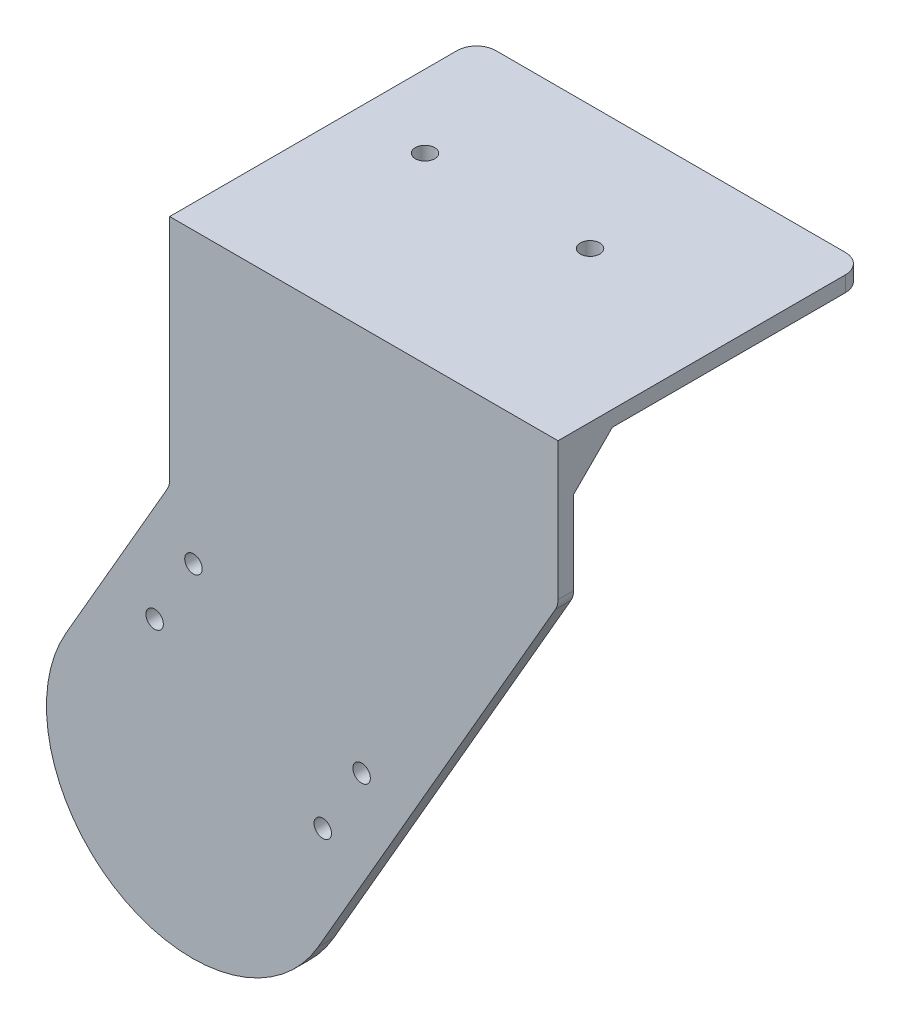
ISO-10303-21;
HEADER;
FILE_DESCRIPTION(('STEP AP214'),'2;1');
FILE_NAME('part.step','',(''),(''),'','','');
FILE_SCHEMA(('AUTOMOTIVE_DESIGN { 1 0 10303 214 1 1 1 1 }'));
ENDSEC;
DATA;
#1=APPLICATION_CONTEXT('core data for automotive mechanical design processes');
#2=APPLICATION_PROTOCOL_DEFINITION('international standard','automotive_design',2000,#1);
#3=PRODUCT_CONTEXT('',#1,'mechanical');
#4=PRODUCT('Part','Part','',(#3));
#5=PRODUCT_RELATED_PRODUCT_CATEGORY('part','',(#4));
#6=PRODUCT_DEFINITION_FORMATION('','',#4);
#7=PRODUCT_DEFINITION_CONTEXT('part definition',#1,'design');
#8=PRODUCT_DEFINITION('design','',#6,#7);
#9=PRODUCT_DEFINITION_SHAPE('','',#8);
#10=(LENGTH_UNIT() NAMED_UNIT(*) SI_UNIT(.MILLI.,.METRE.));
#11=(NAMED_UNIT(*) PLANE_ANGLE_UNIT() SI_UNIT($,.RADIAN.));
#12=(NAMED_UNIT(*) SI_UNIT($,.STERADIAN.) SOLID_ANGLE_UNIT());
#13=UNCERTAINTY_MEASURE_WITH_UNIT(LENGTH_MEASURE(1.E-05),#10,'distance_accuracy_value','');
#14=(GEOMETRIC_REPRESENTATION_CONTEXT(3) GLOBAL_UNCERTAINTY_ASSIGNED_CONTEXT((#13)) GLOBAL_UNIT_ASSIGNED_CONTEXT((#10,
#11,#12)) REPRESENTATION_CONTEXT('',''));
#15=CARTESIAN_POINT('',(0.,0.,0.));
#16=DIRECTION('',(0.,0.,1.));
#17=DIRECTION('',(1.,0.,0.));
#18=AXIS2_PLACEMENT_3D('',#15,#16,#17);
#19=CARTESIAN_POINT('',(0.,0.,8.));
#20=DIRECTION('',(0.,0.,-1.));
#21=DIRECTION('',(-1.,0.,0.));
#22=AXIS2_PLACEMENT_3D('',#19,#20,#21);
#23=CYLINDRICAL_SURFACE('',#22,75.);
#24=CARTESIAN_POINT('',(0.,0.,0.));
#25=DIRECTION('',(0.,0.,1.));
#26=DIRECTION('',(-1.,0.,0.));
#27=AXIS2_PLACEMENT_3D('',#24,#25,#26);
#28=CIRCLE('',#27,75.);
#29=CARTESIAN_POINT('',(-64.9519052838328,37.5,0.));
#30=VERTEX_POINT('',#29);
#31=CARTESIAN_POINT('',(64.9519052838328,-37.5000000000001,0.));
#32=VERTEX_POINT('',#31);
#33=EDGE_CURVE('E148',#30,#32,#28,.T.);
#34=ORIENTED_EDGE('',*,*,#33,.T.);
#35=DIRECTION('',(0.,0.,-1.));
#36=VECTOR('',#35,1.);
#37=CARTESIAN_POINT('',(64.9519052838328,-37.5000000000001,8.));
#38=LINE('',#37,#36);
#39=CARTESIAN_POINT('',(64.9519052838328,-37.5000000000001,8.));
#40=VERTEX_POINT('',#39);
#41=EDGE_CURVE('E133',#40,#32,#38,.T.);
#42=ORIENTED_EDGE('',*,*,#41,.F.);
#43=CARTESIAN_POINT('',(0.,0.,8.));
#44=DIRECTION('',(0.,0.,1.));
#45=DIRECTION('',(-1.,0.,0.));
#46=AXIS2_PLACEMENT_3D('',#43,#44,#45);
#47=CIRCLE('',#46,75.);
#48=CARTESIAN_POINT('',(-64.9519052838328,37.5,8.));
#49=VERTEX_POINT('',#48);
#50=EDGE_CURVE('E137',#49,#40,#47,.T.);
#51=ORIENTED_EDGE('',*,*,#50,.F.);
#52=DIRECTION('',(0.,0.,-1.));
#53=VECTOR('',#52,1.);
#54=CARTESIAN_POINT('',(-64.9519052838328,37.5,8.));
#55=LINE('',#54,#53);
#56=EDGE_CURVE('E216',#49,#30,#55,.T.);
#57=ORIENTED_EDGE('',*,*,#56,.T.);
#58=EDGE_LOOP('',(#34,#42,#51,#57));
#59=FACE_BOUND('',#58,.T.);
#60=ADVANCED_FACE('F36',(#59),#23,.T.);
#61=CARTESIAN_POINT('',(64.9519052838328,-37.5000000000001,8.));
#62=DIRECTION('',(-0.866025403784438,0.500000000000001,0.));
#63=DIRECTION('',(-0.500000000000001,-0.866025403784438,0.));
#64=AXIS2_PLACEMENT_3D('',#61,#62,#63);
#65=PLANE('',#64);
#66=DIRECTION('',(0.500000000000001,0.866025403784438,0.));
#67=VECTOR('',#66,1.);
#68=CARTESIAN_POINT('',(64.9519052838328,-37.5000000000001,0.));
#69=LINE('',#68,#67);
#70=CARTESIAN_POINT('',(187.113248654052,174.089653438086,0.));
#71=VERTEX_POINT('',#70);
#72=EDGE_CURVE('E225',#32,#71,#69,.T.);
#73=ORIENTED_EDGE('',*,*,#72,.T.);
#74=DIRECTION('',(0.,0.,-1.));
#75=VECTOR('',#74,1.);
#76=CARTESIAN_POINT('',(187.113248654052,174.089653438086,8.));
#77=LINE('',#76,#75);
#78=CARTESIAN_POINT('',(187.113248654052,174.089653438086,8.));
#79=VERTEX_POINT('',#78);
#80=EDGE_CURVE('E57',#71,#79,#77,.F.);
#81=ORIENTED_EDGE('',*,*,#80,.T.);
#82=DIRECTION('',(0.500000000000001,0.866025403784438,0.));
#83=VECTOR('',#82,1.);
#84=CARTESIAN_POINT('',(64.9519052838328,-37.5000000000001,8.));
#85=LINE('',#84,#83);
#86=EDGE_CURVE('E129',#40,#79,#85,.T.);
#87=ORIENTED_EDGE('',*,*,#86,.F.);
#88=ORIENTED_EDGE('',*,*,#41,.T.);
#89=EDGE_LOOP('',(#73,#81,#87,#88));
#90=FACE_BOUND('',#89,.T.);
#91=ADVANCED_FACE('F131',(#90),#65,.F.);
#92=CARTESIAN_POINT('',(188.452994616208,250.,8.));
#93=DIRECTION('',(-1.,0.,0.));
#94=DIRECTION('',(0.,0.,1.));
#95=AXIS2_PLACEMENT_3D('',#92,#93,#94);
#96=PLANE('',#95);
#97=DIRECTION('',(0.,0.,-1.));
#98=VECTOR('',#97,1.);
#99=CARTESIAN_POINT('',(188.452994616208,242.,0.));
#100=LINE('',#99,#98);
#101=CARTESIAN_POINT('',(188.452994616208,242.,-20.0000000000002));
#102=VERTEX_POINT('',#101);
#103=CARTESIAN_POINT('',(188.452994616208,242.,-140.));
#104=VERTEX_POINT('',#103);
#105=EDGE_CURVE('E226',#102,#104,#100,.T.);
#106=ORIENTED_EDGE('',*,*,#105,.T.);
#107=DIRECTION('',(0.,1.,0.));
#108=VECTOR('',#107,1.);
#109=CARTESIAN_POINT('',(188.452994616208,250.,-140.));
#110=LINE('',#109,#108);
#111=CARTESIAN_POINT('',(188.452994616208,250.,-140.));
#112=VERTEX_POINT('',#111);
#113=EDGE_CURVE('E186',#104,#112,#110,.T.);
#114=ORIENTED_EDGE('',*,*,#113,.T.);
#115=DIRECTION('',(0.,0.,-1.));
#116=VECTOR('',#115,1.);
#117=CARTESIAN_POINT('',(188.452994616208,250.,8.));
#118=LINE('',#117,#116);
#119=CARTESIAN_POINT('',(188.452994616208,250.,8.));
#120=VERTEX_POINT('',#119);
#121=EDGE_CURVE('E150',#120,#112,#118,.T.);
#122=ORIENTED_EDGE('',*,*,#121,.F.);
#123=DIRECTION('',(0.,1.,0.));
#124=VECTOR('',#123,1.);
#125=CARTESIAN_POINT('',(188.452994616208,250.,8.));
#126=LINE('',#125,#124);
#127=CARTESIAN_POINT('',(188.452994616208,179.089653438086,8.));
#128=VERTEX_POINT('',#127);
#129=EDGE_CURVE('E136',#128,#120,#126,.T.);
#130=ORIENTED_EDGE('',*,*,#129,.F.);
#131=DIRECTION('',(0.,0.,-1.));
#132=VECTOR('',#131,1.);
#133=CARTESIAN_POINT('',(188.452994616208,179.089653438086,8.));
#134=LINE('',#133,#132);
#135=CARTESIAN_POINT('',(188.452994616208,179.089653438086,0.));
#136=VERTEX_POINT('',#135);
#137=EDGE_CURVE('E183',#128,#136,#134,.T.);
#138=ORIENTED_EDGE('',*,*,#137,.T.);
#139=DIRECTION('',(0.,1.,0.));
#140=VECTOR('',#139,1.);
#141=CARTESIAN_POINT('',(188.452994616208,250.,0.));
#142=LINE('',#141,#140);
#143=CARTESIAN_POINT('',(188.452994616208,222.,0.));
#144=VERTEX_POINT('',#143);
#145=EDGE_CURVE('E212',#136,#144,#142,.T.);
#146=ORIENTED_EDGE('',*,*,#145,.T.);
#147=DIRECTION('',(0.,-0.707106781186544,0.707106781186551));
#148=VECTOR('',#147,1.);
#149=CARTESIAN_POINT('',(188.452994616208,232.,-9.99999999999993));
#150=LINE('',#149,#148);
#151=EDGE_CURVE('E164',#144,#102,#150,.F.);
#152=ORIENTED_EDGE('',*,*,#151,.T.);
#153=EDGE_LOOP('',(#106,#114,#122,#130,#138,#146,#152));
#154=FACE_BOUND('',#153,.T.);
#155=ADVANCED_FACE('F262',(#154),#96,.F.);
#156=CARTESIAN_POINT('',(-11.5470053837924,250.,8.));
#157=DIRECTION('',(0.,-1.,0.));
#158=DIRECTION('',(0.,0.,-1.));
#159=AXIS2_PLACEMENT_3D('',#156,#157,#158);
#160=PLANE('',#159);
#161=CARTESIAN_POINT('',(110.952994616208,250.,-86.));
#162=DIRECTION('',(0.,1.,0.));
#163=DIRECTION('',(0.,0.,1.));
#164=AXIS2_PLACEMENT_3D('',#161,#162,#163);
#165=CIRCLE('',#164,4.99999999999999);
#166=CARTESIAN_POINT('',(110.952994616208,250.,-81.));
#167=VERTEX_POINT('',#166);
#168=EDGE_CURVE('E253',#167,#167,#165,.T.);
#169=ORIENTED_EDGE('',*,*,#168,.F.);
#170=EDGE_LOOP('',(#169));
#171=FACE_BOUND('',#170,.T.);
#172=CARTESIAN_POINT('',(25.9529946162076,250.,-86.));
#173=DIRECTION('',(0.,1.,0.));
#174=DIRECTION('',(0.,0.,1.));
#175=AXIS2_PLACEMENT_3D('',#172,#173,#174);
#176=CIRCLE('',#175,5.);
#177=CARTESIAN_POINT('',(25.9529946162076,250.,-81.));
#178=VERTEX_POINT('',#177);
#179=EDGE_CURVE('E475',#178,#178,#176,.T.);
#180=ORIENTED_EDGE('',*,*,#179,.F.);
#181=EDGE_LOOP('',(#180));
#182=FACE_BOUND('',#181,.T.);
#183=DIRECTION('',(-1.,0.,0.));
#184=VECTOR('',#183,1.);
#185=CARTESIAN_POINT('',(338.666176461211,250.,-150.));
#186=LINE('',#185,#184);
#187=CARTESIAN_POINT('',(178.452994616208,250.,-150.));
#188=VERTEX_POINT('',#187);
#189=CARTESIAN_POINT('',(-1.54700538379238,250.,-150.));
#190=VERTEX_POINT('',#189);
#191=EDGE_CURVE('E250',#188,#190,#186,.T.);
#192=ORIENTED_EDGE('',*,*,#191,.T.);
#193=CARTESIAN_POINT('',(-1.5470053837924,250.,-140.));
#194=DIRECTION('',(0.,-1.,0.));
#195=DIRECTION('',(0.,0.,-1.));
#196=AXIS2_PLACEMENT_3D('',#193,#194,#195);
#197=CIRCLE('',#196,10.);
#198=CARTESIAN_POINT('',(-11.5470053837924,250.,-140.));
#199=VERTEX_POINT('',#198);
#200=EDGE_CURVE('E181',#190,#199,#197,.F.);
#201=ORIENTED_EDGE('',*,*,#200,.T.);
#202=DIRECTION('',(0.,0.,-1.));
#203=VECTOR('',#202,1.);
#204=CARTESIAN_POINT('',(-11.5470053837924,250.,8.));
#205=LINE('',#204,#203);
#206=CARTESIAN_POINT('',(-11.5470053837924,250.,8.));
#207=VERTEX_POINT('',#206);
#208=EDGE_CURVE('E156',#207,#199,#205,.T.);
#209=ORIENTED_EDGE('',*,*,#208,.F.);
#210=DIRECTION('',(-1.,0.,0.));
#211=VECTOR('',#210,1.);
#212=CARTESIAN_POINT('',(-11.5470053837924,250.,8.));
#213=LINE('',#212,#211);
#214=EDGE_CURVE('E220',#120,#207,#213,.T.);
#215=ORIENTED_EDGE('',*,*,#214,.F.);
#216=ORIENTED_EDGE('',*,*,#121,.T.);
#217=CARTESIAN_POINT('',(178.452994616208,250.,-140.));
#218=DIRECTION('',(0.,-1.,0.));
#219=DIRECTION('',(0.,0.,-1.));
#220=AXIS2_PLACEMENT_3D('',#217,#218,#219);
#221=CIRCLE('',#220,10.);
#222=EDGE_CURVE('E179',#112,#188,#221,.F.);
#223=ORIENTED_EDGE('',*,*,#222,.T.);
#224=EDGE_LOOP('',(#192,#201,#209,#215,#216,#223));
#225=FACE_BOUND('',#224,.T.);
#226=ADVANCED_FACE('F260',(#171,#182,#225),#160,.F.);
#227=CARTESIAN_POINT('',(-11.5470053837924,130.,8.));
#228=DIRECTION('',(1.,0.,0.));
#229=DIRECTION('',(0.,0.,-1.));
#230=AXIS2_PLACEMENT_3D('',#227,#228,#229);
#231=PLANE('',#230);
#232=ORIENTED_EDGE('',*,*,#208,.T.);
#233=DIRECTION('',(0.,-1.,0.));
#234=VECTOR('',#233,1.);
#235=CARTESIAN_POINT('',(-11.5470053837924,242.,-140.));
#236=LINE('',#235,#234);
#237=CARTESIAN_POINT('',(-11.5470053837924,242.,-140.));
#238=VERTEX_POINT('',#237);
#239=EDGE_CURVE('E168',#199,#238,#236,.T.);
#240=ORIENTED_EDGE('',*,*,#239,.T.);
#241=DIRECTION('',(0.,0.,1.));
#242=VECTOR('',#241,1.);
#243=CARTESIAN_POINT('',(-11.5470053837924,242.,0.));
#244=LINE('',#243,#242);
#245=CARTESIAN_POINT('',(-11.5470053837924,242.,-20.0000000000002));
#246=VERTEX_POINT('',#245);
#247=EDGE_CURVE('E244',#238,#246,#244,.T.);
#248=ORIENTED_EDGE('',*,*,#247,.T.);
#249=DIRECTION('',(0.,0.707106781186544,-0.707106781186551));
#250=VECTOR('',#249,1.);
#251=CARTESIAN_POINT('',(-11.5470053837924,172.000000000001,50.0000000000001));
#252=LINE('',#251,#250);
#253=CARTESIAN_POINT('',(-11.5470053837924,222.,0.));
#254=VERTEX_POINT('',#253);
#255=EDGE_CURVE('E162',#246,#254,#252,.F.);
#256=ORIENTED_EDGE('',*,*,#255,.T.);
#257=DIRECTION('',(0.,-1.,0.));
#258=VECTOR('',#257,1.);
#259=CARTESIAN_POINT('',(-11.5470053837924,130.,0.));
#260=LINE('',#259,#258);
#261=CARTESIAN_POINT('',(-11.5470053837924,132.679491924311,0.));
#262=VERTEX_POINT('',#261);
#263=EDGE_CURVE('E202',#254,#262,#260,.T.);
#264=ORIENTED_EDGE('',*,*,#263,.T.);
#265=DIRECTION('',(0.,0.,-1.));
#266=VECTOR('',#265,1.);
#267=CARTESIAN_POINT('',(-11.5470053837924,132.679491924311,8.));
#268=LINE('',#267,#266);
#269=CARTESIAN_POINT('',(-11.5470053837924,132.679491924311,8.));
#270=VERTEX_POINT('',#269);
#271=EDGE_CURVE('E166',#262,#270,#268,.F.);
#272=ORIENTED_EDGE('',*,*,#271,.T.);
#273=DIRECTION('',(0.,-1.,0.));
#274=VECTOR('',#273,1.);
#275=CARTESIAN_POINT('',(-11.5470053837924,130.,8.));
#276=LINE('',#275,#274);
#277=EDGE_CURVE('E217',#207,#270,#276,.T.);
#278=ORIENTED_EDGE('',*,*,#277,.F.);
#279=EDGE_LOOP('',(#232,#240,#248,#256,#264,#272,#278));
#280=FACE_BOUND('',#279,.T.);
#281=ADVANCED_FACE('F209',(#280),#231,.F.);
#282=CARTESIAN_POINT('',(-64.9519052838328,37.5,8.));
#283=DIRECTION('',(0.866025403784438,-0.5,0.));
#284=DIRECTION('',(0.5,0.866025403784438,0.));
#285=AXIS2_PLACEMENT_3D('',#282,#283,#284);
#286=PLANE('',#285);
#287=DIRECTION('',(-0.5,-0.866025403784438,0.));
#288=VECTOR('',#287,1.);
#289=CARTESIAN_POINT('',(-64.9519052838328,37.5,8.));
#290=LINE('',#289,#288);
#291=CARTESIAN_POINT('',(-12.886751345948,127.679491924311,8.));
#292=VERTEX_POINT('',#291);
#293=EDGE_CURVE('E141',#292,#49,#290,.T.);
#294=ORIENTED_EDGE('',*,*,#293,.F.);
#295=DIRECTION('',(0.,0.,-1.));
#296=VECTOR('',#295,1.);
#297=CARTESIAN_POINT('',(-12.886751345948,127.679491924311,0.));
#298=LINE('',#297,#296);
#299=CARTESIAN_POINT('',(-12.886751345948,127.679491924311,0.));
#300=VERTEX_POINT('',#299);
#301=EDGE_CURVE('E194',#292,#300,#298,.T.);
#302=ORIENTED_EDGE('',*,*,#301,.T.);
#303=DIRECTION('',(-0.5,-0.866025403784438,0.));
#304=VECTOR('',#303,1.);
#305=CARTESIAN_POINT('',(-64.9519052838328,37.5,0.));
#306=LINE('',#305,#304);
#307=EDGE_CURVE('E145',#300,#30,#306,.T.);
#308=ORIENTED_EDGE('',*,*,#307,.T.);
#309=ORIENTED_EDGE('',*,*,#56,.F.);
#310=EDGE_LOOP('',(#294,#302,#308,#309));
#311=FACE_BOUND('',#310,.T.);
#312=ADVANCED_FACE('F215',(#311),#286,.F.);
#313=CARTESIAN_POINT('',(0.,0.,8.));
#314=DIRECTION('',(0.,0.,-1.));
#315=DIRECTION('',(-1.,0.,0.));
#316=AXIS2_PLACEMENT_3D('',#313,#314,#315);
#317=PLANE('',#316);
#318=CARTESIAN_POINT('',(87.301270189222,51.2102355330306,8.));
#319=DIRECTION('',(0.,0.,-1.));
#320=DIRECTION('',(-1.,0.,0.));
#321=AXIS2_PLACEMENT_3D('',#318,#319,#320);
#322=CIRCLE('',#321,4.50000000000001);
#323=CARTESIAN_POINT('',(82.801270189222,51.2102355330306,8.));
#324=VERTEX_POINT('',#323);
#325=EDGE_CURVE('E505',#324,#324,#322,.T.);
#326=ORIENTED_EDGE('',*,*,#325,.T.);
#327=EDGE_LOOP('',(#326));
#328=FACE_BOUND('',#327,.T.);
#329=CARTESIAN_POINT('',(67.301270189222,16.569219381653,8.));
#330=DIRECTION('',(0.,0.,-1.));
#331=DIRECTION('',(-1.,0.,0.));
#332=AXIS2_PLACEMENT_3D('',#329,#330,#331);
#333=CIRCLE('',#332,4.5);
#334=CARTESIAN_POINT('',(62.801270189222,16.569219381653,8.));
#335=VERTEX_POINT('',#334);
#336=EDGE_CURVE('E499',#335,#335,#333,.T.);
#337=ORIENTED_EDGE('',*,*,#336,.T.);
#338=EDGE_LOOP('',(#337));
#339=FACE_BOUND('',#338,.T.);
#340=CARTESIAN_POINT('',(-19.3012701892219,66.569219381653,8.));
#341=DIRECTION('',(0.,0.,-1.));
#342=DIRECTION('',(-1.,0.,0.));
#343=AXIS2_PLACEMENT_3D('',#340,#341,#342);
#344=CIRCLE('',#343,4.50000000000002);
#345=CARTESIAN_POINT('',(-23.8012701892219,66.569219381653,8.));
#346=VERTEX_POINT('',#345);
#347=EDGE_CURVE('E493',#346,#346,#344,.T.);
#348=ORIENTED_EDGE('',*,*,#347,.T.);
#349=EDGE_LOOP('',(#348));
#350=FACE_BOUND('',#349,.T.);
#351=CARTESIAN_POINT('',(0.698729810778129,101.210235533031,8.));
#352=DIRECTION('',(0.,0.,-1.));
#353=DIRECTION('',(-1.,0.,0.));
#354=AXIS2_PLACEMENT_3D('',#351,#352,#353);
#355=CIRCLE('',#354,4.50000000000002);
#356=CARTESIAN_POINT('',(-3.8012701892219,101.210235533031,8.));
#357=VERTEX_POINT('',#356);
#358=EDGE_CURVE('E487',#357,#357,#355,.T.);
#359=ORIENTED_EDGE('',*,*,#358,.T.);
#360=EDGE_LOOP('',(#359));
#361=FACE_BOUND('',#360,.T.);
#362=ORIENTED_EDGE('',*,*,#86,.T.);
#363=CARTESIAN_POINT('',(178.452994616208,179.089653438086,8.));
#364=DIRECTION('',(0.,0.,-1.));
#365=DIRECTION('',(-1.,0.,0.));
#366=AXIS2_PLACEMENT_3D('',#363,#364,#365);
#367=CIRCLE('',#366,10.);
#368=EDGE_CURVE('E192',#79,#128,#367,.F.);
#369=ORIENTED_EDGE('',*,*,#368,.T.);
#370=ORIENTED_EDGE('',*,*,#129,.T.);
#371=ORIENTED_EDGE('',*,*,#214,.T.);
#372=ORIENTED_EDGE('',*,*,#277,.T.);
#373=CARTESIAN_POINT('',(-21.5470053837924,132.679491924311,8.));
#374=DIRECTION('',(0.,0.,-1.));
#375=DIRECTION('',(-1.,0.,0.));
#376=AXIS2_PLACEMENT_3D('',#373,#374,#375);
#377=CIRCLE('',#376,10.);
#378=EDGE_CURVE('E11',#270,#292,#377,.T.);
#379=ORIENTED_EDGE('',*,*,#378,.T.);
#380=ORIENTED_EDGE('',*,*,#293,.T.);
#381=ORIENTED_EDGE('',*,*,#50,.T.);
#382=EDGE_LOOP('',(#362,#369,#370,#371,#372,#379,#380,#381));
#383=FACE_BOUND('',#382,.T.);
#384=ADVANCED_FACE('F140',(#328,#339,#350,#361,#383),#317,.F.);
#385=CARTESIAN_POINT('',(0.,0.,0.));
#386=DIRECTION('',(0.,0.,-1.));
#387=DIRECTION('',(-1.,0.,0.));
#388=AXIS2_PLACEMENT_3D('',#385,#386,#387);
#389=PLANE('',#388);
#390=CARTESIAN_POINT('',(87.301270189222,51.2102355330306,0.));
#391=DIRECTION('',(0.,0.,1.));
#392=DIRECTION('',(1.,0.,0.));
#393=AXIS2_PLACEMENT_3D('',#390,#391,#392);
#394=CIRCLE('',#393,4.50000000000001);
#395=CARTESIAN_POINT('',(91.801270189222,51.2102355330306,0.));
#396=VERTEX_POINT('',#395);
#397=EDGE_CURVE('E483',#396,#396,#394,.T.);
#398=ORIENTED_EDGE('',*,*,#397,.T.);
#399=EDGE_LOOP('',(#398));
#400=FACE_BOUND('',#399,.T.);
#401=CARTESIAN_POINT('',(67.301270189222,16.569219381653,0.));
#402=DIRECTION('',(0.,0.,1.));
#403=DIRECTION('',(1.,0.,0.));
#404=AXIS2_PLACEMENT_3D('',#401,#402,#403);
#405=CIRCLE('',#404,4.5);
#406=CARTESIAN_POINT('',(71.801270189222,16.569219381653,0.));
#407=VERTEX_POINT('',#406);
#408=EDGE_CURVE('E502',#407,#407,#405,.T.);
#409=ORIENTED_EDGE('',*,*,#408,.T.);
#410=EDGE_LOOP('',(#409));
#411=FACE_BOUND('',#410,.T.);
#412=CARTESIAN_POINT('',(-19.3012701892219,66.569219381653,0.));
#413=DIRECTION('',(0.,0.,1.));
#414=DIRECTION('',(1.,0.,0.));
#415=AXIS2_PLACEMENT_3D('',#412,#413,#414);
#416=CIRCLE('',#415,4.50000000000002);
#417=CARTESIAN_POINT('',(-14.8012701892219,66.569219381653,0.));
#418=VERTEX_POINT('',#417);
#419=EDGE_CURVE('E496',#418,#418,#416,.T.);
#420=ORIENTED_EDGE('',*,*,#419,.T.);
#421=EDGE_LOOP('',(#420));
#422=FACE_BOUND('',#421,.T.);
#423=CARTESIAN_POINT('',(0.698729810778129,101.210235533031,0.));
#424=DIRECTION('',(0.,0.,1.));
#425=DIRECTION('',(1.,0.,0.));
#426=AXIS2_PLACEMENT_3D('',#423,#424,#425);
#427=CIRCLE('',#426,4.50000000000002);
#428=CARTESIAN_POINT('',(5.19872981077815,101.210235533031,0.));
#429=VERTEX_POINT('',#428);
#430=EDGE_CURVE('E490',#429,#429,#427,.T.);
#431=ORIENTED_EDGE('',*,*,#430,.T.);
#432=EDGE_LOOP('',(#431));
#433=FACE_BOUND('',#432,.T.);
#434=ORIENTED_EDGE('',*,*,#145,.F.);
#435=CARTESIAN_POINT('',(178.452994616208,179.089653438086,0.));
#436=DIRECTION('',(0.,0.,-1.));
#437=DIRECTION('',(-1.,0.,0.));
#438=AXIS2_PLACEMENT_3D('',#435,#436,#437);
#439=CIRCLE('',#438,10.);
#440=EDGE_CURVE('E189',#136,#71,#439,.T.);
#441=ORIENTED_EDGE('',*,*,#440,.T.);
#442=ORIENTED_EDGE('',*,*,#72,.F.);
#443=ORIENTED_EDGE('',*,*,#33,.F.);
#444=ORIENTED_EDGE('',*,*,#307,.F.);
#445=CARTESIAN_POINT('',(-21.5470053837924,132.679491924311,0.));
#446=DIRECTION('',(0.,0.,-1.));
#447=DIRECTION('',(-1.,0.,0.));
#448=AXIS2_PLACEMENT_3D('',#445,#446,#447);
#449=CIRCLE('',#448,10.);
#450=EDGE_CURVE('E44',#300,#262,#449,.F.);
#451=ORIENTED_EDGE('',*,*,#450,.T.);
#452=ORIENTED_EDGE('',*,*,#263,.F.);
#453=DIRECTION('',(1.,0.,0.));
#454=VECTOR('',#453,1.);
#455=CARTESIAN_POINT('',(188.452994616208,222.,0.));
#456=LINE('',#455,#454);
#457=EDGE_CURVE('E153',#254,#144,#456,.T.);
#458=ORIENTED_EDGE('',*,*,#457,.T.);
#459=EDGE_LOOP('',(#434,#441,#442,#443,#444,#451,#452,#458));
#460=FACE_BOUND('',#459,.T.);
#461=ADVANCED_FACE('F201',(#400,#411,#422,#433,#460),#389,.T.);
#462=CARTESIAN_POINT('',(338.666176461211,-5.20417042793039E-13,-149.999999999999));
#463=DIRECTION('',(0.,0.,-1.));
#464=DIRECTION('',(0.,1.,0.));
#465=AXIS2_PLACEMENT_3D('',#462,#463,#464);
#466=PLANE('',#465);
#467=DIRECTION('',(-1.,0.,0.));
#468=VECTOR('',#467,1.);
#469=CARTESIAN_POINT('',(338.666176461211,242.,-150.));
#470=LINE('',#469,#468);
#471=CARTESIAN_POINT('',(178.452994616208,242.,-150.));
#472=VERTEX_POINT('',#471);
#473=CARTESIAN_POINT('',(-1.54700538379238,242.,-150.));
#474=VERTEX_POINT('',#473);
#475=EDGE_CURVE('E242',#472,#474,#470,.T.);
#476=ORIENTED_EDGE('',*,*,#475,.T.);
#477=DIRECTION('',(0.,-1.,0.));
#478=VECTOR('',#477,1.);
#479=CARTESIAN_POINT('',(-1.5470053837924,250.,-150.));
#480=LINE('',#479,#478);
#481=EDGE_CURVE('E177',#474,#190,#480,.F.);
#482=ORIENTED_EDGE('',*,*,#481,.T.);
#483=ORIENTED_EDGE('',*,*,#191,.F.);
#484=DIRECTION('',(0.,1.,0.));
#485=VECTOR('',#484,1.);
#486=CARTESIAN_POINT('',(178.452994616208,242.,-150.));
#487=LINE('',#486,#485);
#488=EDGE_CURVE('E175',#188,#472,#487,.F.);
#489=ORIENTED_EDGE('',*,*,#488,.T.);
#490=EDGE_LOOP('',(#476,#482,#483,#489));
#491=FACE_BOUND('',#490,.T.);
#492=ADVANCED_FACE('F246',(#491),#466,.T.);
#493=CARTESIAN_POINT('',(338.666176461211,242.,0.));
#494=DIRECTION('',(0.,-1.,0.));
#495=DIRECTION('',(0.,0.,-1.));
#496=AXIS2_PLACEMENT_3D('',#493,#494,#495);
#497=PLANE('',#496);
#498=CARTESIAN_POINT('',(110.952994616208,242.,-86.));
#499=DIRECTION('',(0.,-1.,0.));
#500=DIRECTION('',(0.,0.,-1.));
#501=AXIS2_PLACEMENT_3D('',#498,#499,#500);
#502=CIRCLE('',#501,4.99999999999999);
#503=CARTESIAN_POINT('',(110.952994616208,242.,-91.));
#504=VERTEX_POINT('',#503);
#505=EDGE_CURVE('E477',#504,#504,#502,.F.);
#506=ORIENTED_EDGE('',*,*,#505,.T.);
#507=EDGE_LOOP('',(#506));
#508=FACE_BOUND('',#507,.T.);
#509=CARTESIAN_POINT('',(25.9529946162076,242.,-86.));
#510=DIRECTION('',(0.,-1.,0.));
#511=DIRECTION('',(0.,0.,-1.));
#512=AXIS2_PLACEMENT_3D('',#509,#510,#511);
#513=CIRCLE('',#512,5.);
#514=CARTESIAN_POINT('',(25.9529946162076,242.,-91.));
#515=VERTEX_POINT('',#514);
#516=EDGE_CURVE('E478',#515,#515,#513,.F.);
#517=ORIENTED_EDGE('',*,*,#516,.T.);
#518=EDGE_LOOP('',(#517));
#519=FACE_BOUND('',#518,.T.);
#520=ORIENTED_EDGE('',*,*,#247,.F.);
#521=CARTESIAN_POINT('',(-1.5470053837924,242.,-140.));
#522=DIRECTION('',(0.,-1.,0.));
#523=DIRECTION('',(0.,0.,-1.));
#524=AXIS2_PLACEMENT_3D('',#521,#522,#523);
#525=CIRCLE('',#524,10.);
#526=EDGE_CURVE('E173',#238,#474,#525,.T.);
#527=ORIENTED_EDGE('',*,*,#526,.T.);
#528=ORIENTED_EDGE('',*,*,#475,.F.);
#529=CARTESIAN_POINT('',(178.452994616208,242.,-140.));
#530=DIRECTION('',(0.,-1.,0.));
#531=DIRECTION('',(0.,0.,-1.));
#532=AXIS2_PLACEMENT_3D('',#529,#530,#531);
#533=CIRCLE('',#532,10.);
#534=EDGE_CURVE('E171',#472,#104,#533,.T.);
#535=ORIENTED_EDGE('',*,*,#534,.T.);
#536=ORIENTED_EDGE('',*,*,#105,.F.);
#537=DIRECTION('',(-1.,0.,0.));
#538=VECTOR('',#537,1.);
#539=CARTESIAN_POINT('',(-11.5470053837924,242.,-20.0000000000002));
#540=LINE('',#539,#538);
#541=EDGE_CURVE('E149',#102,#246,#540,.T.);
#542=ORIENTED_EDGE('',*,*,#541,.T.);
#543=EDGE_LOOP('',(#520,#527,#528,#535,#536,#542));
#544=FACE_BOUND('',#543,.T.);
#545=ADVANCED_FACE('F241',(#508,#519,#544),#497,.T.);
#546=CARTESIAN_POINT('',(338.666176461211,242.,-20.0000000000002));
#547=DIRECTION('',(0.,-0.707106781186551,-0.707106781186543));
#548=DIRECTION('',(1.,0.,0.));
#549=AXIS2_PLACEMENT_3D('',#546,#547,#548);
#550=PLANE('',#549);
#551=ORIENTED_EDGE('',*,*,#151,.F.);
#552=ORIENTED_EDGE('',*,*,#457,.F.);
#553=ORIENTED_EDGE('',*,*,#255,.F.);
#554=ORIENTED_EDGE('',*,*,#541,.F.);
#555=EDGE_LOOP('',(#551,#552,#553,#554));
#556=FACE_BOUND('',#555,.T.);
#557=ADVANCED_FACE('F271',(#556),#550,.T.);
#558=CARTESIAN_POINT('',(25.9529946162076,-75.001,-86.));
#559=DIRECTION('',(0.,1.,0.));
#560=DIRECTION('',(0.,0.,1.));
#561=AXIS2_PLACEMENT_3D('',#558,#559,#560);
#562=CYLINDRICAL_SURFACE('',#561,5.);
#563=ORIENTED_EDGE('',*,*,#516,.F.);
#564=EDGE_LOOP('',(#563));
#565=FACE_BOUND('',#564,.T.);
#566=ORIENTED_EDGE('',*,*,#179,.T.);
#567=EDGE_LOOP('',(#566));
#568=FACE_BOUND('',#567,.T.);
#569=ADVANCED_FACE('F293',(#565,#568),#562,.F.);
#570=CARTESIAN_POINT('',(110.952994616208,-75.001,-86.));
#571=DIRECTION('',(0.,1.,0.));
#572=DIRECTION('',(0.,0.,1.));
#573=AXIS2_PLACEMENT_3D('',#570,#571,#572);
#574=CYLINDRICAL_SURFACE('',#573,4.99999999999999);
#575=ORIENTED_EDGE('',*,*,#505,.F.);
#576=EDGE_LOOP('',(#575));
#577=FACE_BOUND('',#576,.T.);
#578=ORIENTED_EDGE('',*,*,#168,.T.);
#579=EDGE_LOOP('',(#578));
#580=FACE_BOUND('',#579,.T.);
#581=ADVANCED_FACE('F317',(#577,#580),#574,.F.);
#582=CARTESIAN_POINT('',(0.698729810778129,101.210235533031,8.001));
#583=DIRECTION('',(0.,0.,-1.));
#584=DIRECTION('',(-1.,0.,0.));
#585=AXIS2_PLACEMENT_3D('',#582,#583,#584);
#586=CYLINDRICAL_SURFACE('',#585,4.50000000000002);
#587=ORIENTED_EDGE('',*,*,#430,.F.);
#588=EDGE_LOOP('',(#587));
#589=FACE_BOUND('',#588,.T.);
#590=ORIENTED_EDGE('',*,*,#358,.F.);
#591=EDGE_LOOP('',(#590));
#592=FACE_BOUND('',#591,.T.);
#593=ADVANCED_FACE('F313',(#589,#592),#586,.F.);
#594=CARTESIAN_POINT('',(-19.3012701892219,66.569219381653,8.001));
#595=DIRECTION('',(0.,0.,-1.));
#596=DIRECTION('',(-1.,0.,0.));
#597=AXIS2_PLACEMENT_3D('',#594,#595,#596);
#598=CYLINDRICAL_SURFACE('',#597,4.50000000000002);
#599=ORIENTED_EDGE('',*,*,#419,.F.);
#600=EDGE_LOOP('',(#599));
#601=FACE_BOUND('',#600,.T.);
#602=ORIENTED_EDGE('',*,*,#347,.F.);
#603=EDGE_LOOP('',(#602));
#604=FACE_BOUND('',#603,.T.);
#605=ADVANCED_FACE('F305',(#601,#604),#598,.F.);
#606=CARTESIAN_POINT('',(67.301270189222,16.569219381653,8.001));
#607=DIRECTION('',(0.,0.,-1.));
#608=DIRECTION('',(-1.,0.,0.));
#609=AXIS2_PLACEMENT_3D('',#606,#607,#608);
#610=CYLINDRICAL_SURFACE('',#609,4.5);
#611=ORIENTED_EDGE('',*,*,#408,.F.);
#612=EDGE_LOOP('',(#611));
#613=FACE_BOUND('',#612,.T.);
#614=ORIENTED_EDGE('',*,*,#336,.F.);
#615=EDGE_LOOP('',(#614));
#616=FACE_BOUND('',#615,.T.);
#617=ADVANCED_FACE('F299',(#613,#616),#610,.F.);
#618=CARTESIAN_POINT('',(87.301270189222,51.2102355330306,8.001));
#619=DIRECTION('',(0.,0.,-1.));
#620=DIRECTION('',(-1.,0.,0.));
#621=AXIS2_PLACEMENT_3D('',#618,#619,#620);
#622=CYLINDRICAL_SURFACE('',#621,4.50000000000001);
#623=ORIENTED_EDGE('',*,*,#397,.F.);
#624=EDGE_LOOP('',(#623));
#625=FACE_BOUND('',#624,.T.);
#626=ORIENTED_EDGE('',*,*,#325,.F.);
#627=EDGE_LOOP('',(#626));
#628=FACE_BOUND('',#627,.T.);
#629=ADVANCED_FACE('F295',(#625,#628),#622,.F.);
#630=CARTESIAN_POINT('',(-1.5470053837924,130.,-140.));
#631=DIRECTION('',(0.,1.,0.));
#632=DIRECTION('',(0.,0.,1.));
#633=AXIS2_PLACEMENT_3D('',#630,#631,#632);
#634=CYLINDRICAL_SURFACE('',#633,10.);
#635=ORIENTED_EDGE('',*,*,#200,.F.);
#636=ORIENTED_EDGE('',*,*,#481,.F.);
#637=ORIENTED_EDGE('',*,*,#526,.F.);
#638=ORIENTED_EDGE('',*,*,#239,.F.);
#639=EDGE_LOOP('',(#635,#636,#637,#638));
#640=FACE_BOUND('',#639,.T.);
#641=ADVANCED_FACE('F236',(#640),#634,.T.);
#642=CARTESIAN_POINT('',(178.452994616208,249.999999999999,-140.));
#643=DIRECTION('',(0.,-1.,0.));
#644=DIRECTION('',(0.,0.,-1.));
#645=AXIS2_PLACEMENT_3D('',#642,#643,#644);
#646=CYLINDRICAL_SURFACE('',#645,10.);
#647=ORIENTED_EDGE('',*,*,#534,.F.);
#648=ORIENTED_EDGE('',*,*,#488,.F.);
#649=ORIENTED_EDGE('',*,*,#222,.F.);
#650=ORIENTED_EDGE('',*,*,#113,.F.);
#651=EDGE_LOOP('',(#647,#648,#649,#650));
#652=FACE_BOUND('',#651,.T.);
#653=ADVANCED_FACE('F267',(#652),#646,.T.);
#654=CARTESIAN_POINT('',(178.452994616208,179.089653438086,8.));
#655=DIRECTION('',(0.,0.,-1.));
#656=DIRECTION('',(-1.,0.,0.));
#657=AXIS2_PLACEMENT_3D('',#654,#655,#656);
#658=CYLINDRICAL_SURFACE('',#657,10.);
#659=ORIENTED_EDGE('',*,*,#368,.F.);
#660=ORIENTED_EDGE('',*,*,#80,.F.);
#661=ORIENTED_EDGE('',*,*,#440,.F.);
#662=ORIENTED_EDGE('',*,*,#137,.F.);
#663=EDGE_LOOP('',(#659,#660,#661,#662));
#664=FACE_BOUND('',#663,.T.);
#665=ADVANCED_FACE('F273',(#664),#658,.T.);
#666=CARTESIAN_POINT('',(-21.5470053837924,132.679491924311,8.));
#667=DIRECTION('',(0.,0.,1.));
#668=DIRECTION('',(1.,0.,0.));
#669=AXIS2_PLACEMENT_3D('',#666,#667,#668);
#670=CYLINDRICAL_SURFACE('',#669,10.);
#671=ORIENTED_EDGE('',*,*,#378,.F.);
#672=ORIENTED_EDGE('',*,*,#271,.F.);
#673=ORIENTED_EDGE('',*,*,#450,.F.);
#674=ORIENTED_EDGE('',*,*,#301,.F.);
#675=EDGE_LOOP('',(#671,#672,#673,#674));
#676=FACE_BOUND('',#675,.T.);
#677=ADVANCED_FACE('F38',(#676),#670,.F.);
#678=CLOSED_SHELL('',(#60,#91,#155,#226,#281,#312,#384,#461,#492,#545,#557,#569,#581,#593,#605,
#617,#629,#641,#653,#665,#677));
#679=MANIFOLD_SOLID_BREP('B2',#678);
#680=ADVANCED_BREP_SHAPE_REPRESENTATION('',(#18,#679),#14);
#681=SHAPE_DEFINITION_REPRESENTATION(#9,#680);
ENDSEC;
END-ISO-10303-21;
